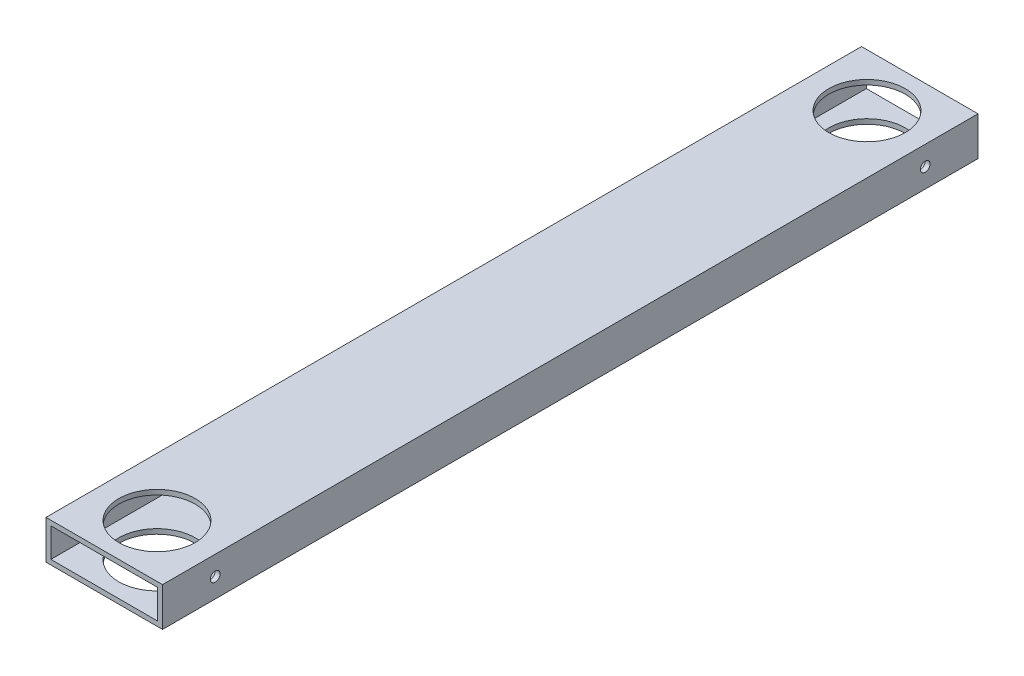
ISO-10303-21;
HEADER;
FILE_DESCRIPTION(('STEP AP214'),'2;1');
FILE_NAME('part.step','',(''),(''),'','','');
FILE_SCHEMA(('AUTOMOTIVE_DESIGN { 1 0 10303 214 1 1 1 1 }'));
ENDSEC;
DATA;
#1=APPLICATION_CONTEXT('core data for automotive mechanical design processes');
#2=APPLICATION_PROTOCOL_DEFINITION('international standard','automotive_design',2000,#1);
#3=PRODUCT_CONTEXT('',#1,'mechanical');
#4=PRODUCT('Part','Part','',(#3));
#5=PRODUCT_RELATED_PRODUCT_CATEGORY('part','',(#4));
#6=PRODUCT_DEFINITION_FORMATION('','',#4);
#7=PRODUCT_DEFINITION_CONTEXT('part definition',#1,'design');
#8=PRODUCT_DEFINITION('design','',#6,#7);
#9=PRODUCT_DEFINITION_SHAPE('','',#8);
#10=(LENGTH_UNIT() NAMED_UNIT(*) SI_UNIT(.MILLI.,.METRE.));
#11=(NAMED_UNIT(*) PLANE_ANGLE_UNIT() SI_UNIT($,.RADIAN.));
#12=(NAMED_UNIT(*) SI_UNIT($,.STERADIAN.) SOLID_ANGLE_UNIT());
#13=UNCERTAINTY_MEASURE_WITH_UNIT(LENGTH_MEASURE(1.E-05),#10,'distance_accuracy_value','');
#14=(GEOMETRIC_REPRESENTATION_CONTEXT(3) GLOBAL_UNCERTAINTY_ASSIGNED_CONTEXT((#13)) GLOBAL_UNIT_ASSIGNED_CONTEXT((#10,
#11,#12)) REPRESENTATION_CONTEXT('',''));
#15=CARTESIAN_POINT('',(0.,0.,0.));
#16=DIRECTION('',(0.,0.,1.));
#17=DIRECTION('',(1.,0.,0.));
#18=AXIS2_PLACEMENT_3D('',#15,#16,#17);
#19=CARTESIAN_POINT('',(0.,0.,533.4));
#20=DIRECTION('',(0.,0.,1.));
#21=DIRECTION('',(1.,0.,0.));
#22=AXIS2_PLACEMENT_3D('',#19,#20,#21);
#23=PLANE('',#22);
#24=DIRECTION('',(0.,1.,0.));
#25=VECTOR('',#24,1.);
#26=CARTESIAN_POINT('',(38.1,-12.7,533.4));
#27=LINE('',#26,#25);
#28=CARTESIAN_POINT('',(38.1,-12.7,533.4));
#29=VERTEX_POINT('',#28);
#30=CARTESIAN_POINT('',(38.1,12.7,533.4));
#31=VERTEX_POINT('',#30);
#32=EDGE_CURVE('E181',#29,#31,#27,.T.);
#33=ORIENTED_EDGE('',*,*,#32,.T.);
#34=DIRECTION('',(-1.,0.,0.));
#35=VECTOR('',#34,1.);
#36=CARTESIAN_POINT('',(-38.1,12.7,533.4));
#37=LINE('',#36,#35);
#38=CARTESIAN_POINT('',(-38.1,12.7,533.4));
#39=VERTEX_POINT('',#38);
#40=EDGE_CURVE('E185',#31,#39,#37,.T.);
#41=ORIENTED_EDGE('',*,*,#40,.T.);
#42=DIRECTION('',(0.,-1.,0.));
#43=VECTOR('',#42,1.);
#44=CARTESIAN_POINT('',(-38.1,-12.7,533.4));
#45=LINE('',#44,#43);
#46=CARTESIAN_POINT('',(-38.1,-12.7,533.4));
#47=VERTEX_POINT('',#46);
#48=EDGE_CURVE('E189',#39,#47,#45,.T.);
#49=ORIENTED_EDGE('',*,*,#48,.T.);
#50=DIRECTION('',(1.,0.,0.));
#51=VECTOR('',#50,1.);
#52=CARTESIAN_POINT('',(-38.1,-12.7,533.4));
#53=LINE('',#52,#51);
#54=EDGE_CURVE('E192',#47,#29,#53,.T.);
#55=ORIENTED_EDGE('',*,*,#54,.T.);
#56=EDGE_LOOP('',(#33,#41,#49,#55));
#57=FACE_BOUND('',#56,.T.);
#58=DIRECTION('',(-1.,0.,0.));
#59=VECTOR('',#58,1.);
#60=CARTESIAN_POINT('',(0.,9.525,533.4));
#61=LINE('',#60,#59);
#62=CARTESIAN_POINT('',(34.925,9.525,533.4));
#63=VERTEX_POINT('',#62);
#64=CARTESIAN_POINT('',(-34.925,9.525,533.4));
#65=VERTEX_POINT('',#64);
#66=EDGE_CURVE('E140',#63,#65,#61,.T.);
#67=ORIENTED_EDGE('',*,*,#66,.F.);
#68=DIRECTION('',(0.,1.,0.));
#69=VECTOR('',#68,1.);
#70=CARTESIAN_POINT('',(34.925,0.,533.4));
#71=LINE('',#70,#69);
#72=CARTESIAN_POINT('',(34.925,-9.525,533.4));
#73=VERTEX_POINT('',#72);
#74=EDGE_CURVE('E131',#73,#63,#71,.T.);
#75=ORIENTED_EDGE('',*,*,#74,.F.);
#76=DIRECTION('',(1.,0.,0.));
#77=VECTOR('',#76,1.);
#78=CARTESIAN_POINT('',(0.,-9.525,533.4));
#79=LINE('',#78,#77);
#80=CARTESIAN_POINT('',(-34.925,-9.525,533.4));
#81=VERTEX_POINT('',#80);
#82=EDGE_CURVE('E157',#81,#73,#79,.T.);
#83=ORIENTED_EDGE('',*,*,#82,.F.);
#84=DIRECTION('',(0.,-1.,0.));
#85=VECTOR('',#84,1.);
#86=CARTESIAN_POINT('',(-34.925,0.,533.4));
#87=LINE('',#86,#85);
#88=EDGE_CURVE('E153',#65,#81,#87,.T.);
#89=ORIENTED_EDGE('',*,*,#88,.F.);
#90=EDGE_LOOP('',(#67,#75,#83,#89));
#91=FACE_BOUND('',#90,.T.);
#92=ADVANCED_FACE('F63',(#57,#91),#23,.T.);
#93=CARTESIAN_POINT('',(0.,0.,0.));
#94=DIRECTION('',(0.,0.,1.));
#95=DIRECTION('',(1.,0.,0.));
#96=AXIS2_PLACEMENT_3D('',#93,#94,#95);
#97=PLANE('',#96);
#98=DIRECTION('',(0.,1.,0.));
#99=VECTOR('',#98,1.);
#100=CARTESIAN_POINT('',(38.1,-12.7,0.));
#101=LINE('',#100,#99);
#102=CARTESIAN_POINT('',(38.1,-12.7,0.));
#103=VERTEX_POINT('',#102);
#104=CARTESIAN_POINT('',(38.1,12.7,0.));
#105=VERTEX_POINT('',#104);
#106=EDGE_CURVE('E149',#103,#105,#101,.T.);
#107=ORIENTED_EDGE('',*,*,#106,.F.);
#108=DIRECTION('',(1.,0.,0.));
#109=VECTOR('',#108,1.);
#110=CARTESIAN_POINT('',(-38.1,-12.7,0.));
#111=LINE('',#110,#109);
#112=CARTESIAN_POINT('',(-38.1,-12.7,0.));
#113=VERTEX_POINT('',#112);
#114=EDGE_CURVE('E186',#113,#103,#111,.T.);
#115=ORIENTED_EDGE('',*,*,#114,.F.);
#116=DIRECTION('',(0.,-1.,0.));
#117=VECTOR('',#116,1.);
#118=CARTESIAN_POINT('',(-38.1,-12.7,0.));
#119=LINE('',#118,#117);
#120=CARTESIAN_POINT('',(-38.1,12.7,0.));
#121=VERTEX_POINT('',#120);
#122=EDGE_CURVE('E202',#121,#113,#119,.T.);
#123=ORIENTED_EDGE('',*,*,#122,.F.);
#124=DIRECTION('',(-1.,0.,0.));
#125=VECTOR('',#124,1.);
#126=CARTESIAN_POINT('',(-38.1,12.7,0.));
#127=LINE('',#126,#125);
#128=EDGE_CURVE('E199',#105,#121,#127,.T.);
#129=ORIENTED_EDGE('',*,*,#128,.F.);
#130=EDGE_LOOP('',(#107,#115,#123,#129));
#131=FACE_BOUND('',#130,.T.);
#132=DIRECTION('',(0.,1.,0.));
#133=VECTOR('',#132,1.);
#134=CARTESIAN_POINT('',(34.925,0.,0.));
#135=LINE('',#134,#133);
#136=CARTESIAN_POINT('',(34.925,-9.525,0.));
#137=VERTEX_POINT('',#136);
#138=CARTESIAN_POINT('',(34.925,9.525,0.));
#139=VERTEX_POINT('',#138);
#140=EDGE_CURVE('E89',#137,#139,#135,.T.);
#141=ORIENTED_EDGE('',*,*,#140,.T.);
#142=DIRECTION('',(-1.,0.,0.));
#143=VECTOR('',#142,1.);
#144=CARTESIAN_POINT('',(0.,9.525,0.));
#145=LINE('',#144,#143);
#146=CARTESIAN_POINT('',(-34.925,9.525,0.));
#147=VERTEX_POINT('',#146);
#148=EDGE_CURVE('E147',#139,#147,#145,.T.);
#149=ORIENTED_EDGE('',*,*,#148,.T.);
#150=DIRECTION('',(0.,-1.,0.));
#151=VECTOR('',#150,1.);
#152=CARTESIAN_POINT('',(-34.925,0.,0.));
#153=LINE('',#152,#151);
#154=CARTESIAN_POINT('',(-34.925,-9.525,0.));
#155=VERTEX_POINT('',#154);
#156=EDGE_CURVE('E168',#147,#155,#153,.T.);
#157=ORIENTED_EDGE('',*,*,#156,.T.);
#158=DIRECTION('',(1.,0.,0.));
#159=VECTOR('',#158,1.);
#160=CARTESIAN_POINT('',(0.,-9.525,0.));
#161=LINE('',#160,#159);
#162=EDGE_CURVE('E141',#155,#137,#161,.T.);
#163=ORIENTED_EDGE('',*,*,#162,.T.);
#164=EDGE_LOOP('',(#141,#149,#157,#163));
#165=FACE_BOUND('',#164,.T.);
#166=ADVANCED_FACE('F310',(#131,#165),#97,.F.);
#167=CARTESIAN_POINT('',(38.1,-12.7,533.4));
#168=DIRECTION('',(-1.,0.,0.));
#169=DIRECTION('',(0.,0.,1.));
#170=AXIS2_PLACEMENT_3D('',#167,#168,#169);
#171=PLANE('',#170);
#172=CARTESIAN_POINT('',(38.1,0.,34.49701));
#173=DIRECTION('',(1.,0.,0.));
#174=DIRECTION('',(0.,0.,-1.));
#175=AXIS2_PLACEMENT_3D('',#172,#173,#174);
#176=CIRCLE('',#175,3.175);
#177=CARTESIAN_POINT('',(38.1,0.,31.32201));
#178=VERTEX_POINT('',#177);
#179=EDGE_CURVE('E238',#178,#178,#176,.T.);
#180=ORIENTED_EDGE('',*,*,#179,.F.);
#181=EDGE_LOOP('',(#180));
#182=FACE_BOUND('',#181,.T.);
#183=CARTESIAN_POINT('',(38.1,0.,498.90299));
#184=DIRECTION('',(1.,0.,0.));
#185=DIRECTION('',(0.,0.,1.));
#186=AXIS2_PLACEMENT_3D('',#183,#184,#185);
#187=CIRCLE('',#186,3.17500000000009);
#188=CARTESIAN_POINT('',(38.1,0.,502.07799));
#189=VERTEX_POINT('',#188);
#190=EDGE_CURVE('E250',#189,#189,#187,.T.);
#191=ORIENTED_EDGE('',*,*,#190,.F.);
#192=EDGE_LOOP('',(#191));
#193=FACE_BOUND('',#192,.T.);
#194=ORIENTED_EDGE('',*,*,#106,.T.);
#195=DIRECTION('',(0.,0.,-1.));
#196=VECTOR('',#195,1.);
#197=CARTESIAN_POINT('',(38.1,12.7,533.4));
#198=LINE('',#197,#196);
#199=EDGE_CURVE('E12',#31,#105,#198,.T.);
#200=ORIENTED_EDGE('',*,*,#199,.F.);
#201=ORIENTED_EDGE('',*,*,#32,.F.);
#202=DIRECTION('',(0.,0.,-1.));
#203=VECTOR('',#202,1.);
#204=CARTESIAN_POINT('',(38.1,-12.7,533.4));
#205=LINE('',#204,#203);
#206=EDGE_CURVE('E195',#29,#103,#205,.T.);
#207=ORIENTED_EDGE('',*,*,#206,.T.);
#208=EDGE_LOOP('',(#194,#200,#201,#207));
#209=FACE_BOUND('',#208,.T.);
#210=ADVANCED_FACE('F65',(#182,#193,#209),#171,.F.);
#211=CARTESIAN_POINT('',(-38.1,12.7,533.4));
#212=DIRECTION('',(0.,-1.,0.));
#213=DIRECTION('',(0.,0.,-1.));
#214=AXIS2_PLACEMENT_3D('',#211,#212,#213);
#215=PLANE('',#214);
#216=CARTESIAN_POINT('',(0.,12.7,34.49701));
#217=DIRECTION('',(0.,1.,0.));
#218=DIRECTION('',(0.,0.,1.));
#219=AXIS2_PLACEMENT_3D('',#216,#217,#218);
#220=CIRCLE('',#219,24.97201);
#221=CARTESIAN_POINT('',(0.,12.7,59.46902));
#222=VERTEX_POINT('',#221);
#223=EDGE_CURVE('E262',#222,#222,#220,.T.);
#224=ORIENTED_EDGE('',*,*,#223,.F.);
#225=EDGE_LOOP('',(#224));
#226=FACE_BOUND('',#225,.T.);
#227=CARTESIAN_POINT('',(0.,12.7,498.90299));
#228=DIRECTION('',(0.,1.,0.));
#229=DIRECTION('',(0.,0.,1.));
#230=AXIS2_PLACEMENT_3D('',#227,#228,#229);
#231=CIRCLE('',#230,24.97201);
#232=CARTESIAN_POINT('',(0.,12.7,523.875));
#233=VERTEX_POINT('',#232);
#234=EDGE_CURVE('E258',#233,#233,#231,.T.);
#235=ORIENTED_EDGE('',*,*,#234,.F.);
#236=EDGE_LOOP('',(#235));
#237=FACE_BOUND('',#236,.T.);
#238=ORIENTED_EDGE('',*,*,#128,.T.);
#239=DIRECTION('',(0.,0.,-1.));
#240=VECTOR('',#239,1.);
#241=CARTESIAN_POINT('',(-38.1,12.7,533.4));
#242=LINE('',#241,#240);
#243=EDGE_CURVE('E73',#39,#121,#242,.T.);
#244=ORIENTED_EDGE('',*,*,#243,.F.);
#245=ORIENTED_EDGE('',*,*,#40,.F.);
#246=ORIENTED_EDGE('',*,*,#199,.T.);
#247=EDGE_LOOP('',(#238,#244,#245,#246));
#248=FACE_BOUND('',#247,.T.);
#249=ADVANCED_FACE('F296',(#226,#237,#248),#215,.F.);
#250=CARTESIAN_POINT('',(-38.1,-12.7,533.4));
#251=DIRECTION('',(1.,0.,0.));
#252=DIRECTION('',(0.,0.,-1.));
#253=AXIS2_PLACEMENT_3D('',#250,#251,#252);
#254=PLANE('',#253);
#255=CARTESIAN_POINT('',(-38.1,0.,34.49701));
#256=DIRECTION('',(1.,0.,0.));
#257=DIRECTION('',(0.,0.,-1.));
#258=AXIS2_PLACEMENT_3D('',#255,#256,#257);
#259=CIRCLE('',#258,3.175);
#260=CARTESIAN_POINT('',(-38.1,0.,31.32201));
#261=VERTEX_POINT('',#260);
#262=EDGE_CURVE('E230',#261,#261,#259,.T.);
#263=ORIENTED_EDGE('',*,*,#262,.T.);
#264=EDGE_LOOP('',(#263));
#265=FACE_BOUND('',#264,.T.);
#266=CARTESIAN_POINT('',(-38.1,0.,498.90299));
#267=DIRECTION('',(1.,0.,0.));
#268=DIRECTION('',(0.,0.,1.));
#269=AXIS2_PLACEMENT_3D('',#266,#267,#268);
#270=CIRCLE('',#269,3.17500000000009);
#271=CARTESIAN_POINT('',(-38.1,0.,502.07799));
#272=VERTEX_POINT('',#271);
#273=EDGE_CURVE('E244',#272,#272,#270,.T.);
#274=ORIENTED_EDGE('',*,*,#273,.T.);
#275=EDGE_LOOP('',(#274));
#276=FACE_BOUND('',#275,.T.);
#277=ORIENTED_EDGE('',*,*,#122,.T.);
#278=DIRECTION('',(0.,0.,-1.));
#279=VECTOR('',#278,1.);
#280=CARTESIAN_POINT('',(-38.1,-12.7,533.4));
#281=LINE('',#280,#279);
#282=EDGE_CURVE('E210',#47,#113,#281,.T.);
#283=ORIENTED_EDGE('',*,*,#282,.F.);
#284=ORIENTED_EDGE('',*,*,#48,.F.);
#285=ORIENTED_EDGE('',*,*,#243,.T.);
#286=EDGE_LOOP('',(#277,#283,#284,#285));
#287=FACE_BOUND('',#286,.T.);
#288=ADVANCED_FACE('F299',(#265,#276,#287),#254,.F.);
#289=CARTESIAN_POINT('',(-38.1,-12.7,533.4));
#290=DIRECTION('',(0.,1.,0.));
#291=DIRECTION('',(0.,0.,1.));
#292=AXIS2_PLACEMENT_3D('',#289,#290,#291);
#293=PLANE('',#292);
#294=CARTESIAN_POINT('',(0.,-12.7,34.49701));
#295=DIRECTION('',(0.,1.,0.));
#296=DIRECTION('',(0.,0.,1.));
#297=AXIS2_PLACEMENT_3D('',#294,#295,#296);
#298=CIRCLE('',#297,24.97201);
#299=CARTESIAN_POINT('',(0.,-12.7,59.46902));
#300=VERTEX_POINT('',#299);
#301=EDGE_CURVE('E222',#300,#300,#298,.T.);
#302=ORIENTED_EDGE('',*,*,#301,.T.);
#303=EDGE_LOOP('',(#302));
#304=FACE_BOUND('',#303,.T.);
#305=CARTESIAN_POINT('',(0.,-12.7,498.90299));
#306=DIRECTION('',(0.,1.,0.));
#307=DIRECTION('',(0.,0.,1.));
#308=AXIS2_PLACEMENT_3D('',#305,#306,#307);
#309=CIRCLE('',#308,24.97201);
#310=CARTESIAN_POINT('',(0.,-12.7,523.875));
#311=VERTEX_POINT('',#310);
#312=EDGE_CURVE('E266',#311,#311,#309,.T.);
#313=ORIENTED_EDGE('',*,*,#312,.T.);
#314=EDGE_LOOP('',(#313));
#315=FACE_BOUND('',#314,.T.);
#316=ORIENTED_EDGE('',*,*,#114,.T.);
#317=ORIENTED_EDGE('',*,*,#206,.F.);
#318=ORIENTED_EDGE('',*,*,#54,.F.);
#319=ORIENTED_EDGE('',*,*,#282,.T.);
#320=EDGE_LOOP('',(#316,#317,#318,#319));
#321=FACE_BOUND('',#320,.T.);
#322=ADVANCED_FACE('F314',(#304,#315,#321),#293,.F.);
#323=CARTESIAN_POINT('',(34.925,0.,533.4));
#324=DIRECTION('',(-1.,0.,0.));
#325=DIRECTION('',(0.,0.,1.));
#326=AXIS2_PLACEMENT_3D('',#323,#324,#325);
#327=PLANE('',#326);
#328=CARTESIAN_POINT('',(34.925,0.,34.49701));
#329=DIRECTION('',(-1.,0.,0.));
#330=DIRECTION('',(0.,0.,1.));
#331=AXIS2_PLACEMENT_3D('',#328,#329,#330);
#332=CIRCLE('',#331,3.175);
#333=CARTESIAN_POINT('',(34.925,0.,37.67201));
#334=VERTEX_POINT('',#333);
#335=EDGE_CURVE('E254',#334,#334,#332,.T.);
#336=ORIENTED_EDGE('',*,*,#335,.F.);
#337=EDGE_LOOP('',(#336));
#338=FACE_BOUND('',#337,.T.);
#339=CARTESIAN_POINT('',(34.925,0.,498.90299));
#340=DIRECTION('',(-1.,0.,0.));
#341=DIRECTION('',(0.,0.,1.));
#342=AXIS2_PLACEMENT_3D('',#339,#340,#341);
#343=CIRCLE('',#342,3.17500000000009);
#344=CARTESIAN_POINT('',(34.925,0.,502.07799));
#345=VERTEX_POINT('',#344);
#346=EDGE_CURVE('E229',#345,#345,#343,.T.);
#347=ORIENTED_EDGE('',*,*,#346,.F.);
#348=EDGE_LOOP('',(#347));
#349=FACE_BOUND('',#348,.T.);
#350=ORIENTED_EDGE('',*,*,#140,.F.);
#351=DIRECTION('',(0.,0.,-1.));
#352=VECTOR('',#351,1.);
#353=CARTESIAN_POINT('',(34.925,-9.525,533.4));
#354=LINE('',#353,#352);
#355=EDGE_CURVE('E135',#73,#137,#354,.T.);
#356=ORIENTED_EDGE('',*,*,#355,.F.);
#357=ORIENTED_EDGE('',*,*,#74,.T.);
#358=DIRECTION('',(0.,0.,-1.));
#359=VECTOR('',#358,1.);
#360=CARTESIAN_POINT('',(34.925,9.525,533.4));
#361=LINE('',#360,#359);
#362=EDGE_CURVE('E134',#63,#139,#361,.T.);
#363=ORIENTED_EDGE('',*,*,#362,.T.);
#364=EDGE_LOOP('',(#350,#356,#357,#363));
#365=FACE_BOUND('',#364,.T.);
#366=ADVANCED_FACE('F133',(#338,#349,#365),#327,.T.);
#367=CARTESIAN_POINT('',(0.,9.525,533.4));
#368=DIRECTION('',(0.,-1.,0.));
#369=DIRECTION('',(0.,0.,-1.));
#370=AXIS2_PLACEMENT_3D('',#367,#368,#369);
#371=PLANE('',#370);
#372=CARTESIAN_POINT('',(0.,9.525,34.49701));
#373=DIRECTION('',(0.,-1.,0.));
#374=DIRECTION('',(0.,0.,-1.));
#375=AXIS2_PLACEMENT_3D('',#372,#373,#374);
#376=CIRCLE('',#375,24.97201);
#377=CARTESIAN_POINT('',(0.,9.525,9.52500000000001));
#378=VERTEX_POINT('',#377);
#379=EDGE_CURVE('E165',#378,#378,#376,.T.);
#380=ORIENTED_EDGE('',*,*,#379,.F.);
#381=EDGE_LOOP('',(#380));
#382=FACE_BOUND('',#381,.T.);
#383=CARTESIAN_POINT('',(0.,9.525,498.90299));
#384=DIRECTION('',(0.,-1.,0.));
#385=DIRECTION('',(0.,0.,-1.));
#386=AXIS2_PLACEMENT_3D('',#383,#384,#385);
#387=CIRCLE('',#386,24.97201);
#388=CARTESIAN_POINT('',(0.,9.525,473.93098));
#389=VERTEX_POINT('',#388);
#390=EDGE_CURVE('E221',#389,#389,#387,.T.);
#391=ORIENTED_EDGE('',*,*,#390,.F.);
#392=EDGE_LOOP('',(#391));
#393=FACE_BOUND('',#392,.T.);
#394=ORIENTED_EDGE('',*,*,#148,.F.);
#395=ORIENTED_EDGE('',*,*,#362,.F.);
#396=ORIENTED_EDGE('',*,*,#66,.T.);
#397=DIRECTION('',(0.,0.,-1.));
#398=VECTOR('',#397,1.);
#399=CARTESIAN_POINT('',(-34.925,9.525,533.4));
#400=LINE('',#399,#398);
#401=EDGE_CURVE('E150',#65,#147,#400,.T.);
#402=ORIENTED_EDGE('',*,*,#401,.T.);
#403=EDGE_LOOP('',(#394,#395,#396,#402));
#404=FACE_BOUND('',#403,.T.);
#405=ADVANCED_FACE('F144',(#382,#393,#404),#371,.T.);
#406=CARTESIAN_POINT('',(-34.925,0.,533.4));
#407=DIRECTION('',(1.,0.,0.));
#408=DIRECTION('',(0.,0.,-1.));
#409=AXIS2_PLACEMENT_3D('',#406,#407,#408);
#410=PLANE('',#409);
#411=CARTESIAN_POINT('',(-34.925,0.,34.49701));
#412=DIRECTION('',(1.,0.,0.));
#413=DIRECTION('',(0.,0.,-1.));
#414=AXIS2_PLACEMENT_3D('',#411,#412,#413);
#415=CIRCLE('',#414,3.175);
#416=CARTESIAN_POINT('',(-34.925,0.,31.32201));
#417=VERTEX_POINT('',#416);
#418=EDGE_CURVE('E67',#417,#417,#415,.T.);
#419=ORIENTED_EDGE('',*,*,#418,.F.);
#420=EDGE_LOOP('',(#419));
#421=FACE_BOUND('',#420,.T.);
#422=CARTESIAN_POINT('',(-34.925,0.,498.90299));
#423=DIRECTION('',(1.,0.,0.));
#424=DIRECTION('',(0.,0.,-1.));
#425=AXIS2_PLACEMENT_3D('',#422,#423,#424);
#426=CIRCLE('',#425,3.17500000000009);
#427=CARTESIAN_POINT('',(-34.925,0.,495.72799));
#428=VERTEX_POINT('',#427);
#429=EDGE_CURVE('E226',#428,#428,#426,.T.);
#430=ORIENTED_EDGE('',*,*,#429,.F.);
#431=EDGE_LOOP('',(#430));
#432=FACE_BOUND('',#431,.T.);
#433=ORIENTED_EDGE('',*,*,#156,.F.);
#434=ORIENTED_EDGE('',*,*,#401,.F.);
#435=ORIENTED_EDGE('',*,*,#88,.T.);
#436=DIRECTION('',(0.,0.,-1.));
#437=VECTOR('',#436,1.);
#438=CARTESIAN_POINT('',(-34.925,-9.525,533.4));
#439=LINE('',#438,#437);
#440=EDGE_CURVE('E81',#81,#155,#439,.T.);
#441=ORIENTED_EDGE('',*,*,#440,.T.);
#442=EDGE_LOOP('',(#433,#434,#435,#441));
#443=FACE_BOUND('',#442,.T.);
#444=ADVANCED_FACE('F284',(#421,#432,#443),#410,.T.);
#445=CARTESIAN_POINT('',(0.,-9.525,533.4));
#446=DIRECTION('',(0.,1.,0.));
#447=DIRECTION('',(0.,0.,1.));
#448=AXIS2_PLACEMENT_3D('',#445,#446,#447);
#449=PLANE('',#448);
#450=CARTESIAN_POINT('',(0.,-9.525,34.49701));
#451=DIRECTION('',(0.,1.,0.));
#452=DIRECTION('',(0.,0.,1.));
#453=AXIS2_PLACEMENT_3D('',#450,#451,#452);
#454=CIRCLE('',#453,24.97201);
#455=CARTESIAN_POINT('',(0.,-9.525,59.46902));
#456=VERTEX_POINT('',#455);
#457=EDGE_CURVE('E223',#456,#456,#454,.T.);
#458=ORIENTED_EDGE('',*,*,#457,.F.);
#459=EDGE_LOOP('',(#458));
#460=FACE_BOUND('',#459,.T.);
#461=CARTESIAN_POINT('',(0.,-9.525,498.90299));
#462=DIRECTION('',(0.,1.,0.));
#463=DIRECTION('',(0.,0.,1.));
#464=AXIS2_PLACEMENT_3D('',#461,#462,#463);
#465=CIRCLE('',#464,24.97201);
#466=CARTESIAN_POINT('',(0.,-9.525,523.875));
#467=VERTEX_POINT('',#466);
#468=EDGE_CURVE('E217',#467,#467,#465,.T.);
#469=ORIENTED_EDGE('',*,*,#468,.F.);
#470=EDGE_LOOP('',(#469));
#471=FACE_BOUND('',#470,.T.);
#472=ORIENTED_EDGE('',*,*,#162,.F.);
#473=ORIENTED_EDGE('',*,*,#440,.F.);
#474=ORIENTED_EDGE('',*,*,#82,.T.);
#475=ORIENTED_EDGE('',*,*,#355,.T.);
#476=EDGE_LOOP('',(#472,#473,#474,#475));
#477=FACE_BOUND('',#476,.T.);
#478=ADVANCED_FACE('F396',(#460,#471,#477),#449,.T.);
#479=CARTESIAN_POINT('',(0.,-12.7,498.90299));
#480=DIRECTION('',(0.,1.,0.));
#481=DIRECTION('',(0.,0.,1.));
#482=AXIS2_PLACEMENT_3D('',#479,#480,#481);
#483=CYLINDRICAL_SURFACE('',#482,24.97201);
#484=ORIENTED_EDGE('',*,*,#468,.T.);
#485=EDGE_LOOP('',(#484));
#486=FACE_BOUND('',#485,.T.);
#487=ORIENTED_EDGE('',*,*,#312,.F.);
#488=EDGE_LOOP('',(#487));
#489=FACE_BOUND('',#488,.T.);
#490=ADVANCED_FACE('F293',(#486,#489),#483,.F.);
#491=CARTESIAN_POINT('',(0.,-12.7,34.49701));
#492=DIRECTION('',(0.,1.,0.));
#493=DIRECTION('',(0.,0.,1.));
#494=AXIS2_PLACEMENT_3D('',#491,#492,#493);
#495=CYLINDRICAL_SURFACE('',#494,24.97201);
#496=ORIENTED_EDGE('',*,*,#457,.T.);
#497=EDGE_LOOP('',(#496));
#498=FACE_BOUND('',#497,.T.);
#499=ORIENTED_EDGE('',*,*,#301,.F.);
#500=EDGE_LOOP('',(#499));
#501=FACE_BOUND('',#500,.T.);
#502=ADVANCED_FACE('F291',(#498,#501),#495,.F.);
#503=ORIENTED_EDGE('',*,*,#390,.T.);
#504=EDGE_LOOP('',(#503));
#505=FACE_BOUND('',#504,.T.);
#506=ORIENTED_EDGE('',*,*,#234,.T.);
#507=EDGE_LOOP('',(#506));
#508=FACE_BOUND('',#507,.T.);
#509=ADVANCED_FACE('F288',(#505,#508),#483,.F.);
#510=ORIENTED_EDGE('',*,*,#379,.T.);
#511=EDGE_LOOP('',(#510));
#512=FACE_BOUND('',#511,.T.);
#513=ORIENTED_EDGE('',*,*,#223,.T.);
#514=EDGE_LOOP('',(#513));
#515=FACE_BOUND('',#514,.T.);
#516=ADVANCED_FACE('F279',(#512,#515),#495,.F.);
#517=CARTESIAN_POINT('',(-38.1,0.,498.90299));
#518=DIRECTION('',(1.,0.,0.));
#519=DIRECTION('',(0.,0.,-1.));
#520=AXIS2_PLACEMENT_3D('',#517,#518,#519);
#521=CYLINDRICAL_SURFACE('',#520,3.17500000000009);
#522=ORIENTED_EDGE('',*,*,#429,.T.);
#523=EDGE_LOOP('',(#522));
#524=FACE_BOUND('',#523,.T.);
#525=ORIENTED_EDGE('',*,*,#273,.F.);
#526=EDGE_LOOP('',(#525));
#527=FACE_BOUND('',#526,.T.);
#528=ADVANCED_FACE('F336',(#524,#527),#521,.F.);
#529=CARTESIAN_POINT('',(-38.1,0.,34.49701));
#530=DIRECTION('',(1.,0.,0.));
#531=DIRECTION('',(0.,0.,-1.));
#532=AXIS2_PLACEMENT_3D('',#529,#530,#531);
#533=CYLINDRICAL_SURFACE('',#532,3.175);
#534=ORIENTED_EDGE('',*,*,#418,.T.);
#535=EDGE_LOOP('',(#534));
#536=FACE_BOUND('',#535,.T.);
#537=ORIENTED_EDGE('',*,*,#262,.F.);
#538=EDGE_LOOP('',(#537));
#539=FACE_BOUND('',#538,.T.);
#540=ADVANCED_FACE('F338',(#536,#539),#533,.F.);
#541=ORIENTED_EDGE('',*,*,#346,.T.);
#542=EDGE_LOOP('',(#541));
#543=FACE_BOUND('',#542,.T.);
#544=ORIENTED_EDGE('',*,*,#190,.T.);
#545=EDGE_LOOP('',(#544));
#546=FACE_BOUND('',#545,.T.);
#547=ADVANCED_FACE('F340',(#543,#546),#521,.F.);
#548=ORIENTED_EDGE('',*,*,#335,.T.);
#549=EDGE_LOOP('',(#548));
#550=FACE_BOUND('',#549,.T.);
#551=ORIENTED_EDGE('',*,*,#179,.T.);
#552=EDGE_LOOP('',(#551));
#553=FACE_BOUND('',#552,.T.);
#554=ADVANCED_FACE('F347',(#550,#553),#533,.F.);
#555=CLOSED_SHELL('',(#92,#166,#210,#249,#288,#322,#366,#405,#444,#478,#490,#502,#509,#516,#528,
#540,#547,#554));
#556=MANIFOLD_SOLID_BREP('B2',#555);
#557=ADVANCED_BREP_SHAPE_REPRESENTATION('',(#18,#556),#14);
#558=SHAPE_DEFINITION_REPRESENTATION(#9,#557);
ENDSEC;
END-ISO-10303-21;
